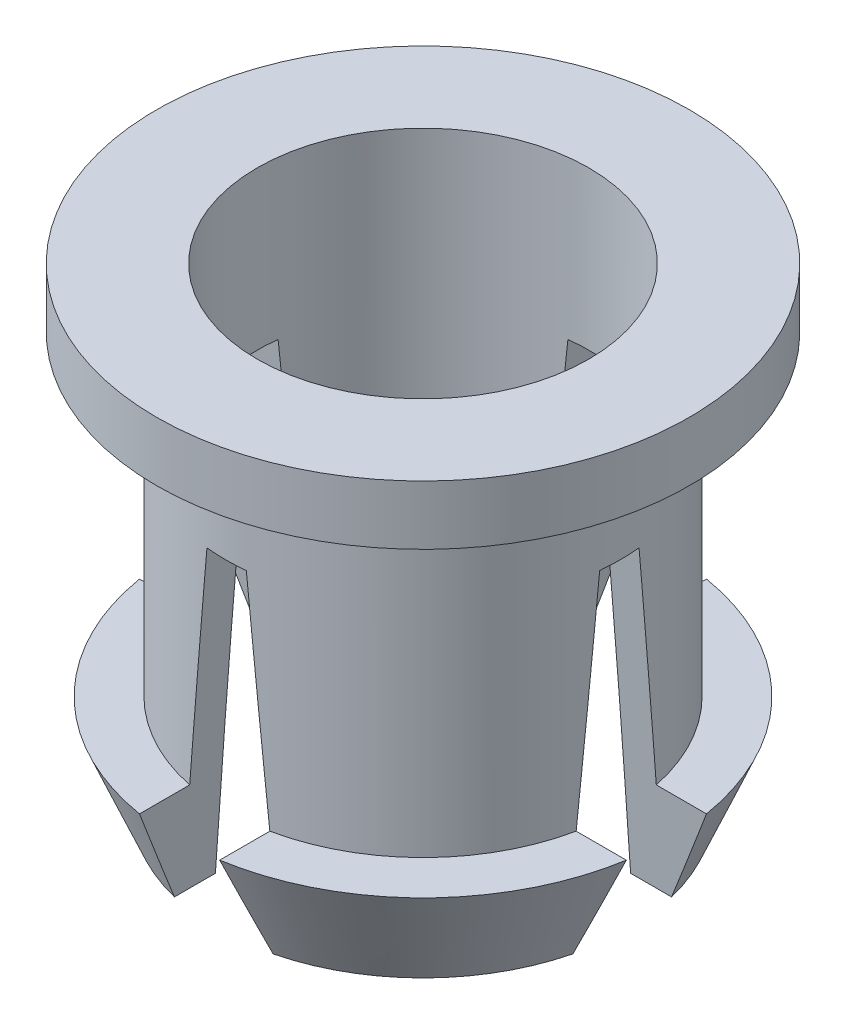
ISO-10303-21;
HEADER;
FILE_DESCRIPTION(('STEP AP214'),'2;1');
FILE_NAME('part.step','',(''),(''),'','','');
FILE_SCHEMA(('AUTOMOTIVE_DESIGN { 1 0 10303 214 1 1 1 1 }'));
ENDSEC;
DATA;
#1=APPLICATION_CONTEXT('core data for automotive mechanical design processes');
#2=APPLICATION_PROTOCOL_DEFINITION('international standard','automotive_design',2000,#1);
#3=PRODUCT_CONTEXT('',#1,'mechanical');
#4=PRODUCT('Part','Part','',(#3));
#5=PRODUCT_RELATED_PRODUCT_CATEGORY('part','',(#4));
#6=PRODUCT_DEFINITION_FORMATION('','',#4);
#7=PRODUCT_DEFINITION_CONTEXT('part definition',#1,'design');
#8=PRODUCT_DEFINITION('design','',#6,#7);
#9=PRODUCT_DEFINITION_SHAPE('','',#8);
#10=(LENGTH_UNIT() NAMED_UNIT(*) SI_UNIT(.MILLI.,.METRE.));
#11=(NAMED_UNIT(*) PLANE_ANGLE_UNIT() SI_UNIT($,.RADIAN.));
#12=(NAMED_UNIT(*) SI_UNIT($,.STERADIAN.) SOLID_ANGLE_UNIT());
#13=UNCERTAINTY_MEASURE_WITH_UNIT(LENGTH_MEASURE(1.E-05),#10,'distance_accuracy_value','');
#14=(GEOMETRIC_REPRESENTATION_CONTEXT(3) GLOBAL_UNCERTAINTY_ASSIGNED_CONTEXT((#13)) GLOBAL_UNIT_ASSIGNED_CONTEXT((#10,
#11,#12)) REPRESENTATION_CONTEXT('',''));
#15=CARTESIAN_POINT('',(0.,0.,0.));
#16=DIRECTION('',(0.,0.,1.));
#17=DIRECTION('',(1.,0.,0.));
#18=AXIS2_PLACEMENT_3D('',#15,#16,#17);
#19=CARTESIAN_POINT('',(2.1,-3.,0.));
#20=DIRECTION('',(0.,1.,0.));
#21=DIRECTION('',(0.,0.,1.));
#22=AXIS2_PLACEMENT_3D('',#19,#20,#21);
#23=PLANE('',#22);
#24=CARTESIAN_POINT('',(0.,-3.,0.));
#25=DIRECTION('',(0.,1.,0.));
#26=DIRECTION('',(0.,0.,1.));
#27=AXIS2_PLACEMENT_3D('',#24,#25,#26);
#28=CIRCLE('',#27,2.6);
#29=CARTESIAN_POINT('',(-2.52376207277944,-3.,0.625000000000009));
#30=VERTEX_POINT('',#29);
#31=CARTESIAN_POINT('',(-0.625,-3.,2.52376207277944));
#32=VERTEX_POINT('',#31);
#33=EDGE_CURVE('E218',#30,#32,#28,.T.);
#34=ORIENTED_EDGE('',*,*,#33,.F.);
#35=DIRECTION('',(1.,0.,0.));
#36=VECTOR('',#35,1.);
#37=CARTESIAN_POINT('',(-3.37500000000001,-3.,0.625000000000012));
#38=LINE('',#37,#36);
#39=CARTESIAN_POINT('',(-2.00483789868408,-3.,0.625000000000007));
#40=VERTEX_POINT('',#39);
#41=EDGE_CURVE('E487',#30,#40,#38,.T.);
#42=ORIENTED_EDGE('',*,*,#41,.T.);
#43=CARTESIAN_POINT('',(0.,-3.,0.));
#44=DIRECTION('',(0.,1.,0.));
#45=DIRECTION('',(0.,0.,1.));
#46=AXIS2_PLACEMENT_3D('',#43,#44,#45);
#47=CIRCLE('',#46,2.1);
#48=CARTESIAN_POINT('',(-0.625,-3.,2.00483789868408));
#49=VERTEX_POINT('',#48);
#50=EDGE_CURVE('E225',#40,#49,#47,.T.);
#51=ORIENTED_EDGE('',*,*,#50,.T.);
#52=DIRECTION('',(0.,0.,1.));
#53=VECTOR('',#52,1.);
#54=CARTESIAN_POINT('',(-0.625,-3.,-3.375));
#55=LINE('',#54,#53);
#56=EDGE_CURVE('E426',#49,#32,#55,.T.);
#57=ORIENTED_EDGE('',*,*,#56,.T.);
#58=EDGE_LOOP('',(#34,#42,#51,#57));
#59=FACE_BOUND('',#58,.T.);
#60=ADVANCED_FACE('F32',(#59),#23,.F.);
#61=CARTESIAN_POINT('',(0.,-3.,0.));
#62=DIRECTION('',(0.,1.,0.));
#63=DIRECTION('',(0.,0.,1.));
#64=AXIS2_PLACEMENT_3D('',#61,#62,#63);
#65=CONICAL_SURFACE('',#64,2.6,0.397627991522129);
#66=CARTESIAN_POINT('',(0.,-1.75,0.));
#67=DIRECTION('',(0.,1.,0.));
#68=DIRECTION('',(0.,0.,1.));
#69=AXIS2_PLACEMENT_3D('',#66,#67,#68);
#70=CIRCLE('',#69,3.125);
#71=CARTESIAN_POINT('',(-3.08348916969804,-1.75,0.507660851706013));
#72=VERTEX_POINT('',#71);
#73=CARTESIAN_POINT('',(-0.507660851706003,-1.75,3.08348916969804));
#74=VERTEX_POINT('',#73);
#75=EDGE_CURVE('E288',#72,#74,#70,.T.);
#76=ORIENTED_EDGE('',*,*,#75,.F.);
#77=CARTESIAN_POINT('',(-3.08357739132101,-1.7498,0.507642077442286));
#78=CARTESIAN_POINT('',(-3.03749931028814,-1.85425701063425,0.517447594771214));
#79=CARTESIAN_POINT('',(-2.99130333072685,-1.95866258349719,0.527248283568721));
#80=CARTESIAN_POINT('',(-2.89863670143563,-2.16735164706901,0.546838201150952));
#81=CARTESIAN_POINT('',(-2.85216605426808,-2.27163513890595,0.556627430041569));
#82=CARTESIAN_POINT('',(-2.75891024874476,-2.48006302847258,0.576192830875539));
#83=CARTESIAN_POINT('',(-2.71212508964057,-2.58420742587056,0.585969002787755));
#84=CARTESIAN_POINT('',(-2.61818697251316,-2.79233279292045,0.605506005434163));
#85=CARTESIAN_POINT('',(-2.57103401106228,-2.89631376103844,0.615266836024363));
#86=CARTESIAN_POINT('',(-2.52367088560967,-3.00019999999999,0.625018774263736));
#87=B_SPLINE_CURVE_WITH_KNOTS('',3,(#77,#78,#79,#80,#81,#82,#83,#84,#85,#86),.UNSPECIFIED.,.F.,
.F.,(4,2,2,2,4),(0.,0.343766631513928,0.687530061063177,1.03129430893586,1.37506176429571),.UNSPECIFIED.);
#88=EDGE_CURVE('E461',#72,#30,#87,.T.);
#89=ORIENTED_EDGE('',*,*,#88,.T.);
#90=ORIENTED_EDGE('',*,*,#33,.T.);
#91=CARTESIAN_POINT('',(-0.625018774263727,-3.0002,2.52367088560967));
#92=CARTESIAN_POINT('',(-0.615266836024355,-2.89631376103844,2.57103401106228));
#93=CARTESIAN_POINT('',(-0.605506005434154,-2.79233279292045,2.61818697251316));
#94=CARTESIAN_POINT('',(-0.585969002787746,-2.58420742587056,2.71212508964057));
#95=CARTESIAN_POINT('',(-0.57619283087553,-2.48006302847258,2.75891024874477));
#96=CARTESIAN_POINT('',(-0.556627430041559,-2.27163513890596,2.85216605426808));
#97=CARTESIAN_POINT('',(-0.546838201150942,-2.16735164706901,2.89863670143563));
#98=CARTESIAN_POINT('',(-0.527248283568711,-1.95866258349719,2.99130333072685));
#99=CARTESIAN_POINT('',(-0.517447594771203,-1.85425701063425,3.03749931028814));
#100=CARTESIAN_POINT('',(-0.507642077442275,-1.7498,3.08357739132101));
#101=B_SPLINE_CURVE_WITH_KNOTS('',3,(#91,#92,#93,#94,#95,#96,#97,#98,#99,#100),.UNSPECIFIED.,
.F.,.F.,(4,2,2,2,4),(0.,0.34376745535985,0.687531703232539,1.03129513278179,1.37506176429572),.UNSPECIFIED.);
#102=EDGE_CURVE('E316',#32,#74,#101,.T.);
#103=ORIENTED_EDGE('',*,*,#102,.T.);
#104=EDGE_LOOP('',(#76,#89,#90,#103));
#105=FACE_BOUND('',#104,.T.);
#106=ADVANCED_FACE('F354',(#105),#65,.T.);
#107=CARTESIAN_POINT('',(3.125,-1.75,0.));
#108=DIRECTION('',(0.,-1.,0.));
#109=DIRECTION('',(0.,0.,-1.));
#110=AXIS2_PLACEMENT_3D('',#107,#108,#109);
#111=PLANE('',#110);
#112=CARTESIAN_POINT('',(0.,-1.75,0.));
#113=DIRECTION('',(0.,1.,0.));
#114=DIRECTION('',(0.,0.,1.));
#115=AXIS2_PLACEMENT_3D('',#112,#113,#114);
#116=CIRCLE('',#115,2.5);
#117=CARTESIAN_POINT('',(-2.44791349104602,-1.75,0.507660851706011));
#118=VERTEX_POINT('',#117);
#119=CARTESIAN_POINT('',(-0.507660851706002,-1.75,2.44791349104602));
#120=VERTEX_POINT('',#119);
#121=EDGE_CURVE('E287',#118,#120,#116,.T.);
#122=ORIENTED_EDGE('',*,*,#121,.F.);
#123=DIRECTION('',(-1.,0.,0.));
#124=VECTOR('',#123,1.);
#125=CARTESIAN_POINT('',(3.125,-1.75,0.507660851705992));
#126=LINE('',#125,#124);
#127=EDGE_CURVE('E469',#118,#72,#126,.T.);
#128=ORIENTED_EDGE('',*,*,#127,.T.);
#129=ORIENTED_EDGE('',*,*,#75,.T.);
#130=DIRECTION('',(0.,0.,-1.));
#131=VECTOR('',#130,1.);
#132=CARTESIAN_POINT('',(-0.507660851706003,-1.75,0.));
#133=LINE('',#132,#131);
#134=EDGE_CURVE('E398',#74,#120,#133,.T.);
#135=ORIENTED_EDGE('',*,*,#134,.T.);
#136=EDGE_LOOP('',(#122,#128,#129,#135));
#137=FACE_BOUND('',#136,.T.);
#138=ADVANCED_FACE('F347',(#137),#111,.F.);
#139=CARTESIAN_POINT('',(0.625,-3.,2.00483789868408));
#140=VERTEX_POINT('',#139);
#141=CARTESIAN_POINT('',(2.00483789868408,-3.,0.624999999999993));
#142=VERTEX_POINT('',#141);
#143=EDGE_CURVE('E231',#140,#142,#47,.T.);
#144=ORIENTED_EDGE('',*,*,#143,.T.);
#145=CARTESIAN_POINT('',(2.52376207277945,-3.,0.624999999999991));
#146=VERTEX_POINT('',#145);
#147=EDGE_CURVE('E488',#142,#146,#38,.T.);
#148=ORIENTED_EDGE('',*,*,#147,.T.);
#149=CARTESIAN_POINT('',(0.625,-3.,2.52376207277945));
#150=VERTEX_POINT('',#149);
#151=EDGE_CURVE('E220',#150,#146,#28,.T.);
#152=ORIENTED_EDGE('',*,*,#151,.F.);
#153=DIRECTION('',(0.,0.,1.));
#154=VECTOR('',#153,1.);
#155=CARTESIAN_POINT('',(0.625,-3.,-3.375));
#156=LINE('',#155,#154);
#157=EDGE_CURVE('E430',#140,#150,#156,.T.);
#158=ORIENTED_EDGE('',*,*,#157,.F.);
#159=EDGE_LOOP('',(#144,#148,#152,#158));
#160=FACE_BOUND('',#159,.T.);
#161=ADVANCED_FACE('F356',(#160),#23,.F.);
#162=ORIENTED_EDGE('',*,*,#151,.T.);
#163=CARTESIAN_POINT('',(2.52367088560967,-3.00019999999999,0.625018774263718));
#164=CARTESIAN_POINT('',(2.57103401106228,-2.89631376103844,0.615266836024345));
#165=CARTESIAN_POINT('',(2.61818697251317,-2.79233279292045,0.605506005434145));
#166=CARTESIAN_POINT('',(2.71212508964057,-2.58420742587056,0.585969002787736));
#167=CARTESIAN_POINT('',(2.75891024874477,-2.48006302847258,0.57619283087552));
#168=CARTESIAN_POINT('',(2.85216605426809,-2.27163513890595,0.556627430041549));
#169=CARTESIAN_POINT('',(2.89863670143564,-2.16735164706901,0.546838201150932));
#170=CARTESIAN_POINT('',(2.99130333072686,-1.95866258349718,0.5272482835687));
#171=CARTESIAN_POINT('',(3.03749931028814,-1.85425701063425,0.517447594771193));
#172=CARTESIAN_POINT('',(3.08357739132101,-1.7498,0.507642077442265));
#173=B_SPLINE_CURVE_WITH_KNOTS('',3,(#163,#164,#165,#166,#167,#168,#169,#170,#171,#172),
.UNSPECIFIED.,.F.,.F.,(4,2,2,2,4),(0.,0.343767455359848,0.687531703232537,1.03129513278179,
1.37506176429571),.UNSPECIFIED.);
#174=CARTESIAN_POINT('',(3.08348916969805,-1.75,0.507660851705992));
#175=VERTEX_POINT('',#174);
#176=EDGE_CURVE('E442',#146,#175,#173,.T.);
#177=ORIENTED_EDGE('',*,*,#176,.T.);
#178=CARTESIAN_POINT('',(0.507660851706003,-1.75,3.08348916969804));
#179=VERTEX_POINT('',#178);
#180=EDGE_CURVE('E221',#179,#175,#70,.T.);
#181=ORIENTED_EDGE('',*,*,#180,.F.);
#182=CARTESIAN_POINT('',(0.507642077442275,-1.7498,3.08357739132101));
#183=CARTESIAN_POINT('',(0.517447594771203,-1.85425701063425,3.03749931028814));
#184=CARTESIAN_POINT('',(0.527248283568711,-1.95866258349719,2.99130333072685));
#185=CARTESIAN_POINT('',(0.546838201150942,-2.16735164706901,2.89863670143563));
#186=CARTESIAN_POINT('',(0.556627430041559,-2.27163513890596,2.85216605426809));
#187=CARTESIAN_POINT('',(0.57619283087553,-2.48006302847258,2.75891024874477));
#188=CARTESIAN_POINT('',(0.585969002787746,-2.58420742587056,2.71212508964057));
#189=CARTESIAN_POINT('',(0.605506005434155,-2.79233279292046,2.61818697251316));
#190=CARTESIAN_POINT('',(0.615266836024355,-2.89631376103844,2.57103401106228));
#191=CARTESIAN_POINT('',(0.625018774263727,-3.0002,2.52367088560967));
#192=B_SPLINE_CURVE_WITH_KNOTS('',3,(#182,#183,#184,#185,#186,#187,#188,#189,#190,#191),
.UNSPECIFIED.,.F.,.F.,(4,2,2,2,4),(0.,0.343766631513929,0.687530061063181,1.03129430893587,
1.37506176429572),.UNSPECIFIED.);
#193=EDGE_CURVE('E413',#179,#150,#192,.T.);
#194=ORIENTED_EDGE('',*,*,#193,.T.);
#195=EDGE_LOOP('',(#162,#177,#181,#194));
#196=FACE_BOUND('',#195,.T.);
#197=ADVANCED_FACE('F366',(#196),#65,.T.);
#198=ORIENTED_EDGE('',*,*,#180,.T.);
#199=DIRECTION('',(-1.,0.,0.));
#200=VECTOR('',#199,1.);
#201=CARTESIAN_POINT('',(3.125,-1.75,0.507660851705992));
#202=LINE('',#201,#200);
#203=CARTESIAN_POINT('',(2.44791349104603,-1.75,0.507660851705994));
#204=VERTEX_POINT('',#203);
#205=EDGE_CURVE('E391',#175,#204,#202,.T.);
#206=ORIENTED_EDGE('',*,*,#205,.T.);
#207=CARTESIAN_POINT('',(0.507660851706003,-1.75,2.44791349104602));
#208=VERTEX_POINT('',#207);
#209=EDGE_CURVE('E284',#208,#204,#116,.T.);
#210=ORIENTED_EDGE('',*,*,#209,.F.);
#211=DIRECTION('',(0.,0.,1.));
#212=VECTOR('',#211,1.);
#213=CARTESIAN_POINT('',(0.507660851706003,-1.75,0.));
#214=LINE('',#213,#212);
#215=EDGE_CURVE('E392',#208,#179,#214,.T.);
#216=ORIENTED_EDGE('',*,*,#215,.T.);
#217=EDGE_LOOP('',(#198,#206,#210,#216));
#218=FACE_BOUND('',#217,.T.);
#219=ADVANCED_FACE('F358',(#218),#111,.F.);
#220=CARTESIAN_POINT('',(-0.625,-3.,-2.00483789868408));
#221=VERTEX_POINT('',#220);
#222=CARTESIAN_POINT('',(-2.00483789868408,-3.,-0.624999999999993));
#223=VERTEX_POINT('',#222);
#224=EDGE_CURVE('E211',#221,#223,#47,.T.);
#225=ORIENTED_EDGE('',*,*,#224,.T.);
#226=DIRECTION('',(1.,0.,0.));
#227=VECTOR('',#226,1.);
#228=CARTESIAN_POINT('',(-3.37500000000001,-3.,-0.624999999999988));
#229=LINE('',#228,#227);
#230=CARTESIAN_POINT('',(-2.52376207277945,-3.,-0.624999999999991));
#231=VERTEX_POINT('',#230);
#232=EDGE_CURVE('E194',#231,#223,#229,.T.);
#233=ORIENTED_EDGE('',*,*,#232,.F.);
#234=CARTESIAN_POINT('',(-0.625,-3.,-2.52376207277944));
#235=VERTEX_POINT('',#234);
#236=EDGE_CURVE('E209',#235,#231,#28,.T.);
#237=ORIENTED_EDGE('',*,*,#236,.F.);
#238=EDGE_CURVE('E428',#235,#221,#55,.T.);
#239=ORIENTED_EDGE('',*,*,#238,.T.);
#240=EDGE_LOOP('',(#225,#233,#237,#239));
#241=FACE_BOUND('',#240,.T.);
#242=ADVANCED_FACE('F207',(#241),#23,.F.);
#243=ORIENTED_EDGE('',*,*,#236,.T.);
#244=CARTESIAN_POINT('',(-2.52367088560967,-3.00019999999999,-0.625018774263718));
#245=CARTESIAN_POINT('',(-2.57103401106228,-2.89631376103844,-0.615266836024345));
#246=CARTESIAN_POINT('',(-2.61818697251316,-2.79233279292045,-0.605506005434145));
#247=CARTESIAN_POINT('',(-2.71212508964057,-2.58420742587056,-0.585969002787736));
#248=CARTESIAN_POINT('',(-2.75891024874477,-2.48006302847258,-0.57619283087552));
#249=CARTESIAN_POINT('',(-2.85216605426809,-2.27163513890595,-0.556627430041549));
#250=CARTESIAN_POINT('',(-2.89863670143563,-2.16735164706901,-0.546838201150932));
#251=CARTESIAN_POINT('',(-2.99130333072686,-1.95866258349718,-0.5272482835687));
#252=CARTESIAN_POINT('',(-3.03749931028814,-1.85425701063425,-0.517447594771193));
#253=CARTESIAN_POINT('',(-3.08357739132101,-1.7498,-0.507642077442265));
#254=B_SPLINE_CURVE_WITH_KNOTS('',3,(#244,#245,#246,#247,#248,#249,#250,#251,#252,#253),
.UNSPECIFIED.,.F.,.F.,(4,2,2,2,4),(0.,0.343767455359849,0.687531703232536,1.03129513278179,
1.37506176429571),.UNSPECIFIED.);
#255=CARTESIAN_POINT('',(-3.08348916969805,-1.75,-0.507660851705992));
#256=VERTEX_POINT('',#255);
#257=EDGE_CURVE('E191',#231,#256,#254,.T.);
#258=ORIENTED_EDGE('',*,*,#257,.T.);
#259=CARTESIAN_POINT('',(-0.507660851706003,-1.75,-3.08348916969804));
#260=VERTEX_POINT('',#259);
#261=EDGE_CURVE('E394',#260,#256,#70,.T.);
#262=ORIENTED_EDGE('',*,*,#261,.F.);
#263=CARTESIAN_POINT('',(-0.507642077442275,-1.7498,-3.08357739132101));
#264=CARTESIAN_POINT('',(-0.517447594771203,-1.85425701063425,-3.03749931028814));
#265=CARTESIAN_POINT('',(-0.52724828356871,-1.95866258349719,-2.99130333072685));
#266=CARTESIAN_POINT('',(-0.546838201150942,-2.16735164706901,-2.89863670143563));
#267=CARTESIAN_POINT('',(-0.556627430041559,-2.27163513890595,-2.85216605426808));
#268=CARTESIAN_POINT('',(-0.57619283087553,-2.48006302847258,-2.75891024874477));
#269=CARTESIAN_POINT('',(-0.585969002787746,-2.58420742587056,-2.71212508964057));
#270=CARTESIAN_POINT('',(-0.605506005434154,-2.79233279292045,-2.61818697251316));
#271=CARTESIAN_POINT('',(-0.615266836024355,-2.89631376103844,-2.57103401106228));
#272=CARTESIAN_POINT('',(-0.625018774263727,-3.0002,-2.52367088560967));
#273=B_SPLINE_CURVE_WITH_KNOTS('',3,(#263,#264,#265,#266,#267,#268,#269,#270,#271,#272),
.UNSPECIFIED.,.F.,.F.,(4,2,2,2,4),(0.,0.343766631513929,0.68753006106318,1.03129430893587,
1.37506176429572),.UNSPECIFIED.);
#274=EDGE_CURVE('E216',#260,#235,#273,.T.);
#275=ORIENTED_EDGE('',*,*,#274,.T.);
#276=EDGE_LOOP('',(#243,#258,#262,#275));
#277=FACE_BOUND('',#276,.T.);
#278=ADVANCED_FACE('F215',(#277),#65,.T.);
#279=ORIENTED_EDGE('',*,*,#261,.T.);
#280=DIRECTION('',(1.,0.,0.));
#281=VECTOR('',#280,1.);
#282=CARTESIAN_POINT('',(3.125,-1.75,-0.507660851706013));
#283=LINE('',#282,#281);
#284=CARTESIAN_POINT('',(-2.44791349104603,-1.75,-0.507660851705994));
#285=VERTEX_POINT('',#284);
#286=EDGE_CURVE('E197',#256,#285,#283,.T.);
#287=ORIENTED_EDGE('',*,*,#286,.T.);
#288=CARTESIAN_POINT('',(-0.507660851706002,-1.75,-2.44791349104602));
#289=VERTEX_POINT('',#288);
#290=EDGE_CURVE('E285',#289,#285,#116,.T.);
#291=ORIENTED_EDGE('',*,*,#290,.F.);
#292=EDGE_CURVE('E315',#289,#260,#133,.T.);
#293=ORIENTED_EDGE('',*,*,#292,.T.);
#294=EDGE_LOOP('',(#279,#287,#291,#293));
#295=FACE_BOUND('',#294,.T.);
#296=ADVANCED_FACE('F348',(#295),#111,.F.);
#297=CARTESIAN_POINT('',(3.375,3.,0.));
#298=DIRECTION('',(0.,-1.,0.));
#299=DIRECTION('',(0.,0.,-1.));
#300=AXIS2_PLACEMENT_3D('',#297,#298,#299);
#301=PLANE('',#300);
#302=CARTESIAN_POINT('',(0.,3.,0.));
#303=DIRECTION('',(0.,1.,0.));
#304=DIRECTION('',(0.,0.,1.));
#305=AXIS2_PLACEMENT_3D('',#302,#303,#304);
#306=CIRCLE('',#305,2.1);
#307=CARTESIAN_POINT('',(0.,3.,2.1));
#308=VERTEX_POINT('',#307);
#309=EDGE_CURVE('E239',#308,#308,#306,.T.);
#310=ORIENTED_EDGE('',*,*,#309,.F.);
#311=EDGE_LOOP('',(#310));
#312=FACE_BOUND('',#311,.T.);
#313=CARTESIAN_POINT('',(0.,3.,0.));
#314=DIRECTION('',(0.,1.,0.));
#315=DIRECTION('',(0.,0.,1.));
#316=AXIS2_PLACEMENT_3D('',#313,#314,#315);
#317=CIRCLE('',#316,3.375);
#318=CARTESIAN_POINT('',(0.,3.,3.375));
#319=VERTEX_POINT('',#318);
#320=EDGE_CURVE('E300',#319,#319,#317,.T.);
#321=ORIENTED_EDGE('',*,*,#320,.T.);
#322=EDGE_LOOP('',(#321));
#323=FACE_BOUND('',#322,.T.);
#324=ADVANCED_FACE('F34',(#312,#323),#301,.F.);
#325=CARTESIAN_POINT('',(0.,3.,0.));
#326=DIRECTION('',(0.,1.,0.));
#327=DIRECTION('',(0.,0.,1.));
#328=AXIS2_PLACEMENT_3D('',#325,#326,#327);
#329=CYLINDRICAL_SURFACE('',#328,2.1);
#330=CARTESIAN_POINT('',(0.,1.,0.));
#331=DIRECTION('',(0.,1.,0.));
#332=DIRECTION('',(0.,0.,1.));
#333=AXIS2_PLACEMENT_3D('',#330,#331,#332);
#334=CIRCLE('',#333,2.1);
#335=CARTESIAN_POINT('',(2.08512407347357,1.,-0.249514725459215));
#336=VERTEX_POINT('',#335);
#337=CARTESIAN_POINT('',(2.08512407347357,1.,0.2495147254592));
#338=VERTEX_POINT('',#337);
#339=EDGE_CURVE('E483',#336,#338,#334,.F.);
#340=ORIENTED_EDGE('',*,*,#339,.T.);
#341=CARTESIAN_POINT('',(0.,3.65805071332671,0.));
#342=DIRECTION('',(0.,0.0934604432801498,0.995622993678771));
#343=DIRECTION('',(0.,0.995622993678771,-0.0934604432801498));
#344=AXIS2_PLACEMENT_3D('',#341,#342,#343);
#345=ELLIPSE('',#344,22.4693990986668,2.1);
#346=EDGE_CURVE('E429',#338,#142,#345,.F.);
#347=ORIENTED_EDGE('',*,*,#346,.T.);
#348=ORIENTED_EDGE('',*,*,#143,.F.);
#349=CARTESIAN_POINT('',(0.,3.65805071332671,0.));
#350=DIRECTION('',(0.995622993678771,0.0934604432801498,0.));
#351=DIRECTION('',(-0.0934604432801498,0.995622993678771,0.));
#352=AXIS2_PLACEMENT_3D('',#349,#350,#351);
#353=ELLIPSE('',#352,22.4693990986668,2.1);
#354=CARTESIAN_POINT('',(0.249514725459208,1.,2.08512407347357));
#355=VERTEX_POINT('',#354);
#356=EDGE_CURVE('E410',#140,#355,#353,.F.);
#357=ORIENTED_EDGE('',*,*,#356,.T.);
#358=CARTESIAN_POINT('',(0.,1.,0.));
#359=DIRECTION('',(0.,1.,0.));
#360=DIRECTION('',(0.,0.,1.));
#361=AXIS2_PLACEMENT_3D('',#358,#359,#360);
#362=CIRCLE('',#361,2.1);
#363=CARTESIAN_POINT('',(-0.249514725459208,1.,2.08512407347357));
#364=VERTEX_POINT('',#363);
#365=EDGE_CURVE('E405',#355,#364,#362,.F.);
#366=ORIENTED_EDGE('',*,*,#365,.T.);
#367=CARTESIAN_POINT('',(0.,3.65805071332672,0.));
#368=DIRECTION('',(-0.995622993678771,0.0934604432801498,0.));
#369=DIRECTION('',(0.0934604432801498,0.995622993678771,0.));
#370=AXIS2_PLACEMENT_3D('',#367,#368,#369);
#371=ELLIPSE('',#370,22.4693990986668,2.1);
#372=EDGE_CURVE('E305',#364,#49,#371,.F.);
#373=ORIENTED_EDGE('',*,*,#372,.T.);
#374=ORIENTED_EDGE('',*,*,#50,.F.);
#375=CARTESIAN_POINT('',(0.,3.65805071332671,0.));
#376=DIRECTION('',(0.,0.0934604432801498,0.995622993678771));
#377=DIRECTION('',(0.,0.995622993678771,-0.0934604432801498));
#378=AXIS2_PLACEMENT_3D('',#375,#376,#377);
#379=ELLIPSE('',#378,22.4693990986668,2.1);
#380=CARTESIAN_POINT('',(-2.08512407347357,1.,0.249514725459215));
#381=VERTEX_POINT('',#380);
#382=EDGE_CURVE('E468',#40,#381,#379,.F.);
#383=ORIENTED_EDGE('',*,*,#382,.T.);
#384=CARTESIAN_POINT('',(-2.08512407347357,1.,-0.2495147254592));
#385=VERTEX_POINT('',#384);
#386=EDGE_CURVE('E495',#381,#385,#334,.F.);
#387=ORIENTED_EDGE('',*,*,#386,.T.);
#388=CARTESIAN_POINT('',(0.,3.65805071332671,0.));
#389=DIRECTION('',(0.,0.0934604432801498,-0.995622993678771));
#390=DIRECTION('',(0.,0.995622993678771,0.0934604432801498));
#391=AXIS2_PLACEMENT_3D('',#388,#389,#390);
#392=ELLIPSE('',#391,22.4693990986668,2.1);
#393=EDGE_CURVE('E202',#385,#223,#392,.F.);
#394=ORIENTED_EDGE('',*,*,#393,.T.);
#395=ORIENTED_EDGE('',*,*,#224,.F.);
#396=CARTESIAN_POINT('',(-0.249514725459208,1.,-2.08512407347357));
#397=VERTEX_POINT('',#396);
#398=EDGE_CURVE('E306',#221,#397,#371,.F.);
#399=ORIENTED_EDGE('',*,*,#398,.T.);
#400=CARTESIAN_POINT('',(0.249514725459208,1.,-2.08512407347357));
#401=VERTEX_POINT('',#400);
#402=EDGE_CURVE('E402',#397,#401,#362,.F.);
#403=ORIENTED_EDGE('',*,*,#402,.T.);
#404=CARTESIAN_POINT('',(0.625,-3.,-2.00483789868408));
#405=VERTEX_POINT('',#404);
#406=EDGE_CURVE('E408',#401,#405,#353,.F.);
#407=ORIENTED_EDGE('',*,*,#406,.T.);
#408=CARTESIAN_POINT('',(2.00483789868408,-3.,-0.625000000000007));
#409=VERTEX_POINT('',#408);
#410=EDGE_CURVE('E230',#409,#405,#47,.T.);
#411=ORIENTED_EDGE('',*,*,#410,.F.);
#412=CARTESIAN_POINT('',(0.,3.65805071332671,0.));
#413=DIRECTION('',(0.,0.0934604432801498,-0.995622993678771));
#414=DIRECTION('',(0.,0.995622993678771,0.0934604432801498));
#415=AXIS2_PLACEMENT_3D('',#412,#413,#414);
#416=ELLIPSE('',#415,22.4693990986668,2.1);
#417=EDGE_CURVE('E479',#409,#336,#416,.F.);
#418=ORIENTED_EDGE('',*,*,#417,.T.);
#419=EDGE_LOOP('',(#340,#347,#348,#357,#366,#373,#374,#383,#387,#394,#395,#399,#403,#407,#411,#418));
#420=FACE_BOUND('',#419,.T.);
#421=ORIENTED_EDGE('',*,*,#309,.T.);
#422=EDGE_LOOP('',(#421));
#423=FACE_BOUND('',#422,.T.);
#424=ADVANCED_FACE('F370',(#420,#423),#329,.F.);
#425=CARTESIAN_POINT('',(2.52376207277944,-3.,-0.625000000000009));
#426=VERTEX_POINT('',#425);
#427=CARTESIAN_POINT('',(0.625,-3.,-2.52376207277945));
#428=VERTEX_POINT('',#427);
#429=EDGE_CURVE('E217',#426,#428,#28,.T.);
#430=ORIENTED_EDGE('',*,*,#429,.F.);
#431=EDGE_CURVE('E212',#409,#426,#229,.T.);
#432=ORIENTED_EDGE('',*,*,#431,.F.);
#433=ORIENTED_EDGE('',*,*,#410,.T.);
#434=EDGE_CURVE('E432',#428,#405,#156,.T.);
#435=ORIENTED_EDGE('',*,*,#434,.F.);
#436=EDGE_LOOP('',(#430,#432,#433,#435));
#437=FACE_BOUND('',#436,.T.);
#438=ADVANCED_FACE('F352',(#437),#23,.F.);
#439=CARTESIAN_POINT('',(3.08348916969804,-1.75,-0.507660851706013));
#440=VERTEX_POINT('',#439);
#441=CARTESIAN_POINT('',(0.507660851706003,-1.75,-3.08348916969804));
#442=VERTEX_POINT('',#441);
#443=EDGE_CURVE('E393',#440,#442,#70,.T.);
#444=ORIENTED_EDGE('',*,*,#443,.F.);
#445=CARTESIAN_POINT('',(3.08357739132101,-1.7498,-0.507642077442286));
#446=CARTESIAN_POINT('',(3.03749931028814,-1.85425701063425,-0.517447594771214));
#447=CARTESIAN_POINT('',(2.99130333072685,-1.95866258349719,-0.527248283568721));
#448=CARTESIAN_POINT('',(2.89863670143563,-2.16735164706901,-0.546838201150952));
#449=CARTESIAN_POINT('',(2.85216605426808,-2.27163513890595,-0.556627430041569));
#450=CARTESIAN_POINT('',(2.75891024874477,-2.48006302847258,-0.576192830875539));
#451=CARTESIAN_POINT('',(2.71212508964057,-2.58420742587056,-0.585969002787755));
#452=CARTESIAN_POINT('',(2.61818697251316,-2.79233279292045,-0.605506005434163));
#453=CARTESIAN_POINT('',(2.57103401106228,-2.89631376103844,-0.615266836024363));
#454=CARTESIAN_POINT('',(2.52367088560967,-3.0002,-0.625018774263736));
#455=B_SPLINE_CURVE_WITH_KNOTS('',3,(#445,#446,#447,#448,#449,#450,#451,#452,#453,#454),
.UNSPECIFIED.,.F.,.F.,(4,2,2,2,4),(0.,0.343766631513928,0.687530061063177,1.03129430893587,
1.37506176429571),.UNSPECIFIED.);
#456=EDGE_CURVE('E474',#440,#426,#455,.T.);
#457=ORIENTED_EDGE('',*,*,#456,.T.);
#458=ORIENTED_EDGE('',*,*,#429,.T.);
#459=CARTESIAN_POINT('',(0.625018774263727,-3.0002,-2.52367088560967));
#460=CARTESIAN_POINT('',(0.615266836024355,-2.89631376103844,-2.57103401106228));
#461=CARTESIAN_POINT('',(0.605506005434155,-2.79233279292045,-2.61818697251316));
#462=CARTESIAN_POINT('',(0.585969002787746,-2.58420742587056,-2.71212508964057));
#463=CARTESIAN_POINT('',(0.57619283087553,-2.48006302847258,-2.75891024874477));
#464=CARTESIAN_POINT('',(0.556627430041559,-2.27163513890596,-2.85216605426809));
#465=CARTESIAN_POINT('',(0.546838201150942,-2.16735164706901,-2.89863670143563));
#466=CARTESIAN_POINT('',(0.527248283568711,-1.95866258349719,-2.99130333072685));
#467=CARTESIAN_POINT('',(0.517447594771203,-1.85425701063425,-3.03749931028814));
#468=CARTESIAN_POINT('',(0.507642077442276,-1.7498,-3.08357739132101));
#469=B_SPLINE_CURVE_WITH_KNOTS('',3,(#459,#460,#461,#462,#463,#464,#465,#466,#467,#468),
.UNSPECIFIED.,.F.,.F.,(4,2,2,2,4),(0.,0.343767455359851,0.68753170323254,1.03129513278179,
1.37506176429572),.UNSPECIFIED.);
#470=EDGE_CURVE('E418',#428,#442,#469,.T.);
#471=ORIENTED_EDGE('',*,*,#470,.T.);
#472=EDGE_LOOP('',(#444,#457,#458,#471));
#473=FACE_BOUND('',#472,.T.);
#474=ADVANCED_FACE('F321',(#473),#65,.T.);
#475=CARTESIAN_POINT('',(2.44791349104602,-1.75,-0.507660851706011));
#476=VERTEX_POINT('',#475);
#477=CARTESIAN_POINT('',(0.507660851706003,-1.75,-2.44791349104602));
#478=VERTEX_POINT('',#477);
#479=EDGE_CURVE('E272',#476,#478,#116,.T.);
#480=ORIENTED_EDGE('',*,*,#479,.F.);
#481=DIRECTION('',(1.,0.,0.));
#482=VECTOR('',#481,1.);
#483=CARTESIAN_POINT('',(3.125,-1.75,-0.507660851706013));
#484=LINE('',#483,#482);
#485=EDGE_CURVE('E280',#476,#440,#484,.T.);
#486=ORIENTED_EDGE('',*,*,#485,.T.);
#487=ORIENTED_EDGE('',*,*,#443,.T.);
#488=EDGE_CURVE('E283',#442,#478,#214,.T.);
#489=ORIENTED_EDGE('',*,*,#488,.T.);
#490=EDGE_LOOP('',(#480,#486,#487,#489));
#491=FACE_BOUND('',#490,.T.);
#492=ADVANCED_FACE('F279',(#491),#111,.F.);
#493=CARTESIAN_POINT('',(0.,3.,0.));
#494=DIRECTION('',(0.,1.,0.));
#495=DIRECTION('',(0.,0.,1.));
#496=AXIS2_PLACEMENT_3D('',#493,#494,#495);
#497=CYLINDRICAL_SURFACE('',#496,2.5);
#498=ORIENTED_EDGE('',*,*,#209,.T.);
#499=CARTESIAN_POINT('',(0.,3.65805071332671,0.));
#500=DIRECTION('',(0.,0.0934604432801498,0.995622993678771));
#501=DIRECTION('',(0.,0.995622993678771,-0.0934604432801498));
#502=AXIS2_PLACEMENT_3D('',#499,#500,#501);
#503=ELLIPSE('',#502,26.74928464127,2.5);
#504=CARTESIAN_POINT('',(2.48751731688023,1.,0.249514725459199));
#505=VERTEX_POINT('',#504);
#506=EDGE_CURVE('E11',#204,#505,#503,.T.);
#507=ORIENTED_EDGE('',*,*,#506,.T.);
#508=CARTESIAN_POINT('',(0.,1.,0.));
#509=DIRECTION('',(0.,1.,0.));
#510=DIRECTION('',(0.,0.,1.));
#511=AXIS2_PLACEMENT_3D('',#508,#509,#510);
#512=CIRCLE('',#511,2.5);
#513=CARTESIAN_POINT('',(2.48751731688023,1.,-0.249514725459216));
#514=VERTEX_POINT('',#513);
#515=EDGE_CURVE('E274',#505,#514,#512,.T.);
#516=ORIENTED_EDGE('',*,*,#515,.T.);
#517=CARTESIAN_POINT('',(0.,3.65805071332671,0.));
#518=DIRECTION('',(0.,0.0934604432801498,-0.995622993678771));
#519=DIRECTION('',(0.,0.995622993678771,0.0934604432801498));
#520=AXIS2_PLACEMENT_3D('',#517,#518,#519);
#521=ELLIPSE('',#520,26.74928464127,2.5);
#522=EDGE_CURVE('E40',#514,#476,#521,.T.);
#523=ORIENTED_EDGE('',*,*,#522,.T.);
#524=ORIENTED_EDGE('',*,*,#479,.T.);
#525=CARTESIAN_POINT('',(0.,3.65805071332671,0.));
#526=DIRECTION('',(0.995622993678771,0.0934604432801498,0.));
#527=DIRECTION('',(-0.0934604432801498,0.995622993678771,0.));
#528=AXIS2_PLACEMENT_3D('',#525,#526,#527);
#529=ELLIPSE('',#528,26.74928464127,2.5);
#530=CARTESIAN_POINT('',(0.249514725459208,1.,-2.48751731688023));
#531=VERTEX_POINT('',#530);
#532=EDGE_CURVE('E245',#478,#531,#529,.T.);
#533=ORIENTED_EDGE('',*,*,#532,.T.);
#534=CARTESIAN_POINT('',(0.,1.,0.));
#535=DIRECTION('',(0.,1.,0.));
#536=DIRECTION('',(0.,0.,1.));
#537=AXIS2_PLACEMENT_3D('',#534,#535,#536);
#538=CIRCLE('',#537,2.5);
#539=CARTESIAN_POINT('',(-0.249514725459208,1.,-2.48751731688023));
#540=VERTEX_POINT('',#539);
#541=EDGE_CURVE('E249',#531,#540,#538,.T.);
#542=ORIENTED_EDGE('',*,*,#541,.T.);
#543=CARTESIAN_POINT('',(0.,3.65805071332672,0.));
#544=DIRECTION('',(-0.995622993678771,0.0934604432801498,0.));
#545=DIRECTION('',(0.0934604432801498,0.995622993678771,0.));
#546=AXIS2_PLACEMENT_3D('',#543,#544,#545);
#547=ELLIPSE('',#546,26.74928464127,2.5);
#548=EDGE_CURVE('E255',#540,#289,#547,.T.);
#549=ORIENTED_EDGE('',*,*,#548,.T.);
#550=ORIENTED_EDGE('',*,*,#290,.T.);
#551=CARTESIAN_POINT('',(0.,3.65805071332671,0.));
#552=DIRECTION('',(0.,0.0934604432801498,-0.995622993678771));
#553=DIRECTION('',(0.,0.995622993678771,0.0934604432801498));
#554=AXIS2_PLACEMENT_3D('',#551,#552,#553);
#555=ELLIPSE('',#554,26.74928464127,2.5);
#556=CARTESIAN_POINT('',(-2.48751731688023,1.,-0.249514725459199));
#557=VERTEX_POINT('',#556);
#558=EDGE_CURVE('E260',#285,#557,#555,.T.);
#559=ORIENTED_EDGE('',*,*,#558,.T.);
#560=CARTESIAN_POINT('',(-2.48751731688023,1.,0.249514725459216));
#561=VERTEX_POINT('',#560);
#562=EDGE_CURVE('E494',#557,#561,#512,.T.);
#563=ORIENTED_EDGE('',*,*,#562,.T.);
#564=CARTESIAN_POINT('',(0.,3.65805071332671,0.));
#565=DIRECTION('',(0.,0.0934604432801498,0.995622993678771));
#566=DIRECTION('',(0.,0.995622993678771,-0.0934604432801498));
#567=AXIS2_PLACEMENT_3D('',#564,#565,#566);
#568=ELLIPSE('',#567,26.74928464127,2.5);
#569=EDGE_CURVE('E263',#561,#118,#568,.T.);
#570=ORIENTED_EDGE('',*,*,#569,.T.);
#571=ORIENTED_EDGE('',*,*,#121,.T.);
#572=CARTESIAN_POINT('',(-0.249514725459208,1.,2.48751731688023));
#573=VERTEX_POINT('',#572);
#574=EDGE_CURVE('E259',#120,#573,#547,.T.);
#575=ORIENTED_EDGE('',*,*,#574,.T.);
#576=CARTESIAN_POINT('',(0.249514725459208,1.,2.48751731688023));
#577=VERTEX_POINT('',#576);
#578=EDGE_CURVE('E256',#573,#577,#538,.T.);
#579=ORIENTED_EDGE('',*,*,#578,.T.);
#580=EDGE_CURVE('E251',#577,#208,#529,.T.);
#581=ORIENTED_EDGE('',*,*,#580,.T.);
#582=EDGE_LOOP('',(#498,#507,#516,#523,#524,#533,#542,#549,#550,#559,#563,#570,#571,#575,#579,#581));
#583=FACE_BOUND('',#582,.T.);
#584=CARTESIAN_POINT('',(0.,2.25,0.));
#585=DIRECTION('',(0.,1.,0.));
#586=DIRECTION('',(0.,0.,1.));
#587=AXIS2_PLACEMENT_3D('',#584,#585,#586);
#588=CIRCLE('',#587,2.5);
#589=CARTESIAN_POINT('',(0.,2.25,2.5));
#590=VERTEX_POINT('',#589);
#591=EDGE_CURVE('E291',#590,#590,#588,.T.);
#592=ORIENTED_EDGE('',*,*,#591,.F.);
#593=EDGE_LOOP('',(#592));
#594=FACE_BOUND('',#593,.T.);
#595=ADVANCED_FACE('F270',(#583,#594),#497,.T.);
#596=CARTESIAN_POINT('',(2.5,2.25,0.));
#597=DIRECTION('',(0.,1.,0.));
#598=DIRECTION('',(0.,0.,1.));
#599=AXIS2_PLACEMENT_3D('',#596,#597,#598);
#600=PLANE('',#599);
#601=CARTESIAN_POINT('',(0.,2.25,0.));
#602=DIRECTION('',(0.,1.,0.));
#603=DIRECTION('',(0.,0.,1.));
#604=AXIS2_PLACEMENT_3D('',#601,#602,#603);
#605=CIRCLE('',#604,3.375);
#606=CARTESIAN_POINT('',(0.,2.25,3.375));
#607=VERTEX_POINT('',#606);
#608=EDGE_CURVE('E296',#607,#607,#605,.T.);
#609=ORIENTED_EDGE('',*,*,#608,.F.);
#610=EDGE_LOOP('',(#609));
#611=FACE_BOUND('',#610,.T.);
#612=ORIENTED_EDGE('',*,*,#591,.T.);
#613=EDGE_LOOP('',(#612));
#614=FACE_BOUND('',#613,.T.);
#615=ADVANCED_FACE('F340',(#611,#614),#600,.F.);
#616=CARTESIAN_POINT('',(0.,3.,0.));
#617=DIRECTION('',(0.,1.,0.));
#618=DIRECTION('',(0.,0.,1.));
#619=AXIS2_PLACEMENT_3D('',#616,#617,#618);
#620=CYLINDRICAL_SURFACE('',#619,3.375);
#621=ORIENTED_EDGE('',*,*,#320,.F.);
#622=EDGE_LOOP('',(#621));
#623=FACE_BOUND('',#622,.T.);
#624=ORIENTED_EDGE('',*,*,#608,.T.);
#625=EDGE_LOOP('',(#624));
#626=FACE_BOUND('',#625,.T.);
#627=ADVANCED_FACE('F336',(#623,#626),#620,.T.);
#628=CARTESIAN_POINT('',(0.249514725459208,1.,-3.375));
#629=DIRECTION('',(0.995622993678771,0.0934604432801498,0.));
#630=DIRECTION('',(-0.0934604432801498,0.995622993678771,0.));
#631=AXIS2_PLACEMENT_3D('',#628,#629,#630);
#632=PLANE('',#631);
#633=DIRECTION('',(0.,0.,1.));
#634=VECTOR('',#633,1.);
#635=CARTESIAN_POINT('',(0.249514725459208,1.,-3.375));
#636=LINE('',#635,#634);
#637=EDGE_CURVE('E436',#531,#401,#636,.T.);
#638=ORIENTED_EDGE('',*,*,#637,.F.);
#639=ORIENTED_EDGE('',*,*,#532,.F.);
#640=ORIENTED_EDGE('',*,*,#488,.F.);
#641=ORIENTED_EDGE('',*,*,#470,.F.);
#642=ORIENTED_EDGE('',*,*,#434,.T.);
#643=ORIENTED_EDGE('',*,*,#406,.F.);
#644=EDGE_LOOP('',(#638,#639,#640,#641,#642,#643));
#645=FACE_BOUND('',#644,.T.);
#646=ADVANCED_FACE('F333',(#645),#632,.F.);
#647=CARTESIAN_POINT('',(-0.249514725459208,1.,-3.375));
#648=DIRECTION('',(0.,1.,0.));
#649=DIRECTION('',(0.,0.,1.));
#650=AXIS2_PLACEMENT_3D('',#647,#648,#649);
#651=PLANE('',#650);
#652=DIRECTION('',(0.,0.,1.));
#653=VECTOR('',#652,1.);
#654=CARTESIAN_POINT('',(-0.249514725459208,1.,-3.375));
#655=LINE('',#654,#653);
#656=EDGE_CURVE('E425',#540,#397,#655,.T.);
#657=ORIENTED_EDGE('',*,*,#656,.F.);
#658=ORIENTED_EDGE('',*,*,#541,.F.);
#659=ORIENTED_EDGE('',*,*,#637,.T.);
#660=ORIENTED_EDGE('',*,*,#402,.F.);
#661=EDGE_LOOP('',(#657,#658,#659,#660));
#662=FACE_BOUND('',#661,.T.);
#663=ADVANCED_FACE('F458',(#662),#651,.F.);
#664=CARTESIAN_POINT('',(-0.625,-3.,-3.375));
#665=DIRECTION('',(-0.995622993678771,0.0934604432801498,0.));
#666=DIRECTION('',(-0.0934604432801498,-0.995622993678771,0.));
#667=AXIS2_PLACEMENT_3D('',#664,#665,#666);
#668=PLANE('',#667);
#669=ORIENTED_EDGE('',*,*,#238,.F.);
#670=ORIENTED_EDGE('',*,*,#274,.F.);
#671=ORIENTED_EDGE('',*,*,#292,.F.);
#672=ORIENTED_EDGE('',*,*,#548,.F.);
#673=ORIENTED_EDGE('',*,*,#656,.T.);
#674=ORIENTED_EDGE('',*,*,#398,.F.);
#675=EDGE_LOOP('',(#669,#670,#671,#672,#673,#674));
#676=FACE_BOUND('',#675,.T.);
#677=ADVANCED_FACE('F331',(#676),#668,.F.);
#678=EDGE_CURVE('E437',#364,#573,#655,.T.);
#679=ORIENTED_EDGE('',*,*,#678,.T.);
#680=ORIENTED_EDGE('',*,*,#574,.F.);
#681=ORIENTED_EDGE('',*,*,#134,.F.);
#682=ORIENTED_EDGE('',*,*,#102,.F.);
#683=ORIENTED_EDGE('',*,*,#56,.F.);
#684=ORIENTED_EDGE('',*,*,#372,.F.);
#685=EDGE_LOOP('',(#679,#680,#681,#682,#683,#684));
#686=FACE_BOUND('',#685,.T.);
#687=ADVANCED_FACE('F325',(#686),#668,.F.);
#688=EDGE_CURVE('E433',#355,#577,#636,.T.);
#689=ORIENTED_EDGE('',*,*,#688,.T.);
#690=ORIENTED_EDGE('',*,*,#578,.F.);
#691=ORIENTED_EDGE('',*,*,#678,.F.);
#692=ORIENTED_EDGE('',*,*,#365,.F.);
#693=EDGE_LOOP('',(#689,#690,#691,#692));
#694=FACE_BOUND('',#693,.T.);
#695=ADVANCED_FACE('F330',(#694),#651,.F.);
#696=ORIENTED_EDGE('',*,*,#157,.T.);
#697=ORIENTED_EDGE('',*,*,#193,.F.);
#698=ORIENTED_EDGE('',*,*,#215,.F.);
#699=ORIENTED_EDGE('',*,*,#580,.F.);
#700=ORIENTED_EDGE('',*,*,#688,.F.);
#701=ORIENTED_EDGE('',*,*,#356,.F.);
#702=EDGE_LOOP('',(#696,#697,#698,#699,#700,#701));
#703=FACE_BOUND('',#702,.T.);
#704=ADVANCED_FACE('F512',(#703),#632,.F.);
#705=CARTESIAN_POINT('',(-3.37500000000001,1.,-0.249514725459196));
#706=DIRECTION('',(0.,0.0934604432801498,-0.995622993678771));
#707=DIRECTION('',(0.,0.995622993678771,0.0934604432801498));
#708=AXIS2_PLACEMENT_3D('',#705,#706,#707);
#709=PLANE('',#708);
#710=DIRECTION('',(1.,0.,0.));
#711=VECTOR('',#710,1.);
#712=CARTESIAN_POINT('',(-3.37500000000001,1.,-0.249514725459196));
#713=LINE('',#712,#711);
#714=EDGE_CURVE('E55',#557,#385,#713,.T.);
#715=ORIENTED_EDGE('',*,*,#714,.F.);
#716=ORIENTED_EDGE('',*,*,#558,.F.);
#717=ORIENTED_EDGE('',*,*,#286,.F.);
#718=ORIENTED_EDGE('',*,*,#257,.F.);
#719=ORIENTED_EDGE('',*,*,#232,.T.);
#720=ORIENTED_EDGE('',*,*,#393,.F.);
#721=EDGE_LOOP('',(#715,#716,#717,#718,#719,#720));
#722=FACE_BOUND('',#721,.T.);
#723=ADVANCED_FACE('F193',(#722),#709,.F.);
#724=CARTESIAN_POINT('',(-3.37500000000001,1.,0.249514725459219));
#725=DIRECTION('',(0.,1.,0.));
#726=DIRECTION('',(0.,0.,1.));
#727=AXIS2_PLACEMENT_3D('',#724,#725,#726);
#728=PLANE('',#727);
#729=DIRECTION('',(1.,0.,0.));
#730=VECTOR('',#729,1.);
#731=CARTESIAN_POINT('',(-3.37500000000001,1.,0.249514725459219));
#732=LINE('',#731,#730);
#733=EDGE_CURVE('E516',#561,#381,#732,.T.);
#734=ORIENTED_EDGE('',*,*,#733,.F.);
#735=ORIENTED_EDGE('',*,*,#562,.F.);
#736=ORIENTED_EDGE('',*,*,#714,.T.);
#737=ORIENTED_EDGE('',*,*,#386,.F.);
#738=EDGE_LOOP('',(#734,#735,#736,#737));
#739=FACE_BOUND('',#738,.T.);
#740=ADVANCED_FACE('F520',(#739),#728,.F.);
#741=CARTESIAN_POINT('',(-3.37500000000001,-3.,0.625000000000012));
#742=DIRECTION('',(0.,0.0934604432801498,0.995622993678771));
#743=DIRECTION('',(0.,-0.995622993678771,0.0934604432801498));
#744=AXIS2_PLACEMENT_3D('',#741,#742,#743);
#745=PLANE('',#744);
#746=ORIENTED_EDGE('',*,*,#41,.F.);
#747=ORIENTED_EDGE('',*,*,#88,.F.);
#748=ORIENTED_EDGE('',*,*,#127,.F.);
#749=ORIENTED_EDGE('',*,*,#569,.F.);
#750=ORIENTED_EDGE('',*,*,#733,.T.);
#751=ORIENTED_EDGE('',*,*,#382,.F.);
#752=EDGE_LOOP('',(#746,#747,#748,#749,#750,#751));
#753=FACE_BOUND('',#752,.T.);
#754=ADVANCED_FACE('F454',(#753),#745,.F.);
#755=EDGE_CURVE('E515',#338,#505,#732,.T.);
#756=ORIENTED_EDGE('',*,*,#755,.T.);
#757=ORIENTED_EDGE('',*,*,#506,.F.);
#758=ORIENTED_EDGE('',*,*,#205,.F.);
#759=ORIENTED_EDGE('',*,*,#176,.F.);
#760=ORIENTED_EDGE('',*,*,#147,.F.);
#761=ORIENTED_EDGE('',*,*,#346,.F.);
#762=EDGE_LOOP('',(#756,#757,#758,#759,#760,#761));
#763=FACE_BOUND('',#762,.T.);
#764=ADVANCED_FACE('F449',(#763),#745,.F.);
#765=ORIENTED_EDGE('',*,*,#431,.T.);
#766=ORIENTED_EDGE('',*,*,#456,.F.);
#767=ORIENTED_EDGE('',*,*,#485,.F.);
#768=ORIENTED_EDGE('',*,*,#522,.F.);
#769=EDGE_CURVE('E47',#336,#514,#713,.T.);
#770=ORIENTED_EDGE('',*,*,#769,.F.);
#771=ORIENTED_EDGE('',*,*,#417,.F.);
#772=EDGE_LOOP('',(#765,#766,#767,#768,#770,#771));
#773=FACE_BOUND('',#772,.T.);
#774=ADVANCED_FACE('F453',(#773),#709,.F.);
#775=ORIENTED_EDGE('',*,*,#769,.T.);
#776=ORIENTED_EDGE('',*,*,#515,.F.);
#777=ORIENTED_EDGE('',*,*,#755,.F.);
#778=ORIENTED_EDGE('',*,*,#339,.F.);
#779=EDGE_LOOP('',(#775,#776,#777,#778));
#780=FACE_BOUND('',#779,.T.);
#781=ADVANCED_FACE('F625',(#780),#728,.F.);
#782=CLOSED_SHELL('',(#60,#106,#138,#161,#197,#219,#242,#278,#296,#324,#424,#438,#474,#492,#595,
#615,#627,#646,#663,#677,#687,#695,#704,#723,#740,#754,#764,#774,#781));
#783=MANIFOLD_SOLID_BREP('B2',#782);
#784=ADVANCED_BREP_SHAPE_REPRESENTATION('',(#18,#783),#14);
#785=SHAPE_DEFINITION_REPRESENTATION(#9,#784);
ENDSEC;
END-ISO-10303-21;
